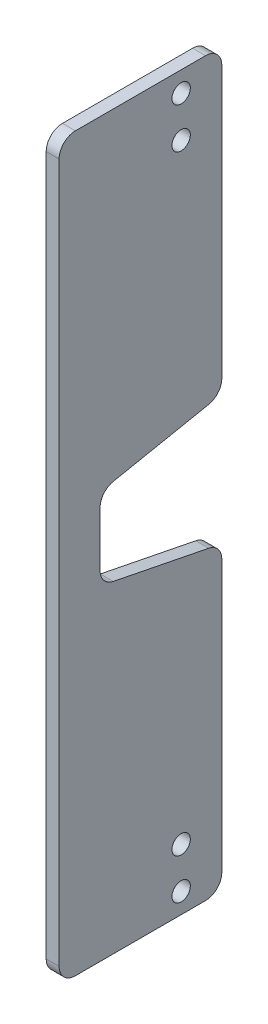
ISO-10303-21;
HEADER;
FILE_DESCRIPTION(('STEP AP214'),'2;1');
FILE_NAME('part.step','',(''),(''),'','','');
FILE_SCHEMA(('AUTOMOTIVE_DESIGN { 1 0 10303 214 1 1 1 1 }'));
ENDSEC;
DATA;
#1=APPLICATION_CONTEXT('core data for automotive mechanical design processes');
#2=APPLICATION_PROTOCOL_DEFINITION('international standard','automotive_design',2000,#1);
#3=PRODUCT_CONTEXT('',#1,'mechanical');
#4=PRODUCT('Part','Part','',(#3));
#5=PRODUCT_RELATED_PRODUCT_CATEGORY('part','',(#4));
#6=PRODUCT_DEFINITION_FORMATION('','',#4);
#7=PRODUCT_DEFINITION_CONTEXT('part definition',#1,'design');
#8=PRODUCT_DEFINITION('design','',#6,#7);
#9=PRODUCT_DEFINITION_SHAPE('','',#8);
#10=(LENGTH_UNIT() NAMED_UNIT(*) SI_UNIT(.MILLI.,.METRE.));
#11=(NAMED_UNIT(*) PLANE_ANGLE_UNIT() SI_UNIT($,.RADIAN.));
#12=(NAMED_UNIT(*) SI_UNIT($,.STERADIAN.) SOLID_ANGLE_UNIT());
#13=UNCERTAINTY_MEASURE_WITH_UNIT(LENGTH_MEASURE(1.E-05),#10,'distance_accuracy_value','');
#14=(GEOMETRIC_REPRESENTATION_CONTEXT(3) GLOBAL_UNCERTAINTY_ASSIGNED_CONTEXT((#13)) GLOBAL_UNIT_ASSIGNED_CONTEXT((#10,
#11,#12)) REPRESENTATION_CONTEXT('',''));
#15=CARTESIAN_POINT('',(0.,0.,0.));
#16=DIRECTION('',(0.,0.,1.));
#17=DIRECTION('',(1.,0.,0.));
#18=AXIS2_PLACEMENT_3D('',#15,#16,#17);
#19=CARTESIAN_POINT('',(0.794249999999999,-50.77,-0.0391447555514952));
#20=DIRECTION('',(0.,-0.980796557409384,-0.195033620111768));
#21=DIRECTION('',(0.,0.195033620111768,-0.980796557409384));
#22=AXIS2_PLACEMENT_3D('',#19,#20,#21);
#23=PLANE('',#22);
#24=DIRECTION('',(0.,-0.195033620111768,0.980796557409384));
#25=VECTOR('',#24,1.);
#26=CARTESIAN_POINT('',(0.794249999999999,-50.77,-0.0391447555514952));
#27=LINE('',#26,#25);
#28=CARTESIAN_POINT('',(0.794250000000003,-48.1151387809773,-13.3900672402235));
#29=VERTEX_POINT('',#28);
#30=CARTESIAN_POINT('',(0.794249999999999,-50.4498612190227,-1.64907751532796));
#31=VERTEX_POINT('',#30);
#32=EDGE_CURVE('E248',#29,#31,#27,.T.);
#33=ORIENTED_EDGE('',*,*,#32,.T.);
#34=DIRECTION('',(-1.,0.,0.));
#35=VECTOR('',#34,1.);
#36=CARTESIAN_POINT('',(-0.793750000000001,-50.4498612190227,-1.64907751532796));
#37=LINE('',#36,#35);
#38=CARTESIAN_POINT('',(-0.793750000000001,-50.4498612190227,-1.64907751532796));
#39=VERTEX_POINT('',#38);
#40=EDGE_CURVE('E283',#31,#39,#37,.T.);
#41=ORIENTED_EDGE('',*,*,#40,.T.);
#42=DIRECTION('',(0.,-0.195033620111768,0.980796557409384));
#43=VECTOR('',#42,1.);
#44=CARTESIAN_POINT('',(-0.793750000000002,-50.77,-0.0391447555514957));
#45=LINE('',#44,#43);
#46=CARTESIAN_POINT('',(-0.793749999999997,-48.1151387809773,-13.3900672402235));
#47=VERTEX_POINT('',#46);
#48=EDGE_CURVE('E203',#47,#39,#45,.T.);
#49=ORIENTED_EDGE('',*,*,#48,.F.);
#50=DIRECTION('',(-1.,0.,0.));
#51=VECTOR('',#50,1.);
#52=CARTESIAN_POINT('',(0.794250000000003,-48.1151387809773,-13.3900672402235));
#53=LINE('',#52,#51);
#54=EDGE_CURVE('E277',#47,#29,#53,.F.);
#55=ORIENTED_EDGE('',*,*,#54,.T.);
#56=EDGE_LOOP('',(#33,#41,#49,#55));
#57=FACE_BOUND('',#56,.T.);
#58=ADVANCED_FACE('F39',(#57),#23,.T.);
#59=CARTESIAN_POINT('',(0.794250000000003,-12.795,-15.));
#60=DIRECTION('',(0.,0.,-1.));
#61=DIRECTION('',(-1.,0.,0.));
#62=AXIS2_PLACEMENT_3D('',#59,#60,#61);
#63=PLANE('',#62);
#64=DIRECTION('',(0.,-1.,0.));
#65=VECTOR('',#64,1.);
#66=CARTESIAN_POINT('',(0.794250000000003,-12.795,-15.));
#67=LINE('',#66,#65);
#68=CARTESIAN_POINT('',(0.794250000000003,-12.795,-15.));
#69=VERTEX_POINT('',#68);
#70=CARTESIAN_POINT('',(0.794250000000003,-46.1535456661585,-15.));
#71=VERTEX_POINT('',#70);
#72=EDGE_CURVE('E168',#69,#71,#67,.T.);
#73=ORIENTED_EDGE('',*,*,#72,.T.);
#74=DIRECTION('',(-1.,0.,0.));
#75=VECTOR('',#74,1.);
#76=CARTESIAN_POINT('',(0.794250000000003,-46.1535456661585,-15.));
#77=LINE('',#76,#75);
#78=CARTESIAN_POINT('',(-0.793749999999997,-46.1535456661585,-15.));
#79=VERTEX_POINT('',#78);
#80=EDGE_CURVE('E252',#71,#79,#77,.T.);
#81=ORIENTED_EDGE('',*,*,#80,.T.);
#82=DIRECTION('',(0.,-1.,0.));
#83=VECTOR('',#82,1.);
#84=CARTESIAN_POINT('',(-0.793749999999997,-12.795,-15.));
#85=LINE('',#84,#83);
#86=CARTESIAN_POINT('',(-0.793749999999997,-12.795,-15.));
#87=VERTEX_POINT('',#86);
#88=EDGE_CURVE('E244',#87,#79,#85,.T.);
#89=ORIENTED_EDGE('',*,*,#88,.F.);
#90=DIRECTION('',(-1.,0.,0.));
#91=VECTOR('',#90,1.);
#92=CARTESIAN_POINT('',(0.794250000000003,-12.795,-15.));
#93=LINE('',#92,#91);
#94=EDGE_CURVE('E249',#69,#87,#93,.T.);
#95=ORIENTED_EDGE('',*,*,#94,.F.);
#96=EDGE_LOOP('',(#73,#81,#89,#95));
#97=FACE_BOUND('',#96,.T.);
#98=ADVANCED_FACE('F407',(#97),#63,.T.);
#99=CARTESIAN_POINT('',(0.794250000000003,-12.795,-13.));
#100=DIRECTION('',(-1.,0.,0.));
#101=DIRECTION('',(0.,0.,1.));
#102=AXIS2_PLACEMENT_3D('',#99,#100,#101);
#103=CYLINDRICAL_SURFACE('',#102,2.);
#104=CARTESIAN_POINT('',(-0.793749999999998,-12.795,-13.));
#105=DIRECTION('',(-1.,0.,0.));
#106=DIRECTION('',(0.,0.,1.));
#107=AXIS2_PLACEMENT_3D('',#104,#105,#106);
#108=CIRCLE('',#107,2.);
#109=CARTESIAN_POINT('',(-0.793749999999998,-10.795,-13.));
#110=VERTEX_POINT('',#109);
#111=EDGE_CURVE('E240',#110,#87,#108,.T.);
#112=ORIENTED_EDGE('',*,*,#111,.F.);
#113=DIRECTION('',(-1.,0.,0.));
#114=VECTOR('',#113,1.);
#115=CARTESIAN_POINT('',(0.794250000000003,-10.795,-13.));
#116=LINE('',#115,#114);
#117=CARTESIAN_POINT('',(0.794250000000003,-10.795,-13.));
#118=VERTEX_POINT('',#117);
#119=EDGE_CURVE('E253',#118,#110,#116,.T.);
#120=ORIENTED_EDGE('',*,*,#119,.F.);
#121=CARTESIAN_POINT('',(0.794250000000003,-12.795,-13.));
#122=DIRECTION('',(-1.,0.,0.));
#123=DIRECTION('',(0.,0.,1.));
#124=AXIS2_PLACEMENT_3D('',#121,#122,#123);
#125=CIRCLE('',#124,2.);
#126=EDGE_CURVE('E196',#118,#69,#125,.T.);
#127=ORIENTED_EDGE('',*,*,#126,.T.);
#128=ORIENTED_EDGE('',*,*,#94,.T.);
#129=EDGE_LOOP('',(#112,#120,#127,#128));
#130=FACE_BOUND('',#129,.T.);
#131=ADVANCED_FACE('F413',(#130),#103,.T.);
#132=CARTESIAN_POINT('',(0.794249999999998,-10.795,3.));
#133=DIRECTION('',(0.,1.,0.));
#134=DIRECTION('',(0.,0.,1.));
#135=AXIS2_PLACEMENT_3D('',#132,#133,#134);
#136=PLANE('',#135);
#137=DIRECTION('',(0.,0.,-1.));
#138=VECTOR('',#137,1.);
#139=CARTESIAN_POINT('',(-0.793750000000003,-10.795,3.));
#140=LINE('',#139,#138);
#141=CARTESIAN_POINT('',(-0.793750000000003,-10.795,3.));
#142=VERTEX_POINT('',#141);
#143=EDGE_CURVE('E236',#142,#110,#140,.T.);
#144=ORIENTED_EDGE('',*,*,#143,.F.);
#145=DIRECTION('',(-1.,0.,0.));
#146=VECTOR('',#145,1.);
#147=CARTESIAN_POINT('',(0.794249999999998,-10.795,3.));
#148=LINE('',#147,#146);
#149=CARTESIAN_POINT('',(0.794249999999998,-10.795,3.));
#150=VERTEX_POINT('',#149);
#151=EDGE_CURVE('E256',#150,#142,#148,.T.);
#152=ORIENTED_EDGE('',*,*,#151,.F.);
#153=DIRECTION('',(0.,0.,-1.));
#154=VECTOR('',#153,1.);
#155=CARTESIAN_POINT('',(0.794249999999998,-10.795,3.));
#156=LINE('',#155,#154);
#157=EDGE_CURVE('E192',#150,#118,#156,.T.);
#158=ORIENTED_EDGE('',*,*,#157,.T.);
#159=ORIENTED_EDGE('',*,*,#119,.T.);
#160=EDGE_LOOP('',(#144,#152,#158,#159));
#161=FACE_BOUND('',#160,.T.);
#162=ADVANCED_FACE('F569',(#161),#136,.T.);
#163=CARTESIAN_POINT('',(0.794249999999998,-12.795,3.));
#164=DIRECTION('',(-1.,0.,0.));
#165=DIRECTION('',(0.,0.,1.));
#166=AXIS2_PLACEMENT_3D('',#163,#164,#165);
#167=CYLINDRICAL_SURFACE('',#166,2.);
#168=CARTESIAN_POINT('',(-0.793750000000003,-12.795,3.));
#169=DIRECTION('',(-1.,0.,0.));
#170=DIRECTION('',(0.,0.,1.));
#171=AXIS2_PLACEMENT_3D('',#168,#169,#170);
#172=CIRCLE('',#171,2.);
#173=CARTESIAN_POINT('',(-0.793750000000003,-12.795,5.));
#174=VERTEX_POINT('',#173);
#175=EDGE_CURVE('E232',#174,#142,#172,.T.);
#176=ORIENTED_EDGE('',*,*,#175,.F.);
#177=DIRECTION('',(-1.,0.,0.));
#178=VECTOR('',#177,1.);
#179=CARTESIAN_POINT('',(0.794249999999997,-12.795,5.));
#180=LINE('',#179,#178);
#181=CARTESIAN_POINT('',(0.794249999999997,-12.795,5.));
#182=VERTEX_POINT('',#181);
#183=EDGE_CURVE('E259',#182,#174,#180,.T.);
#184=ORIENTED_EDGE('',*,*,#183,.F.);
#185=CARTESIAN_POINT('',(0.794249999999998,-12.795,3.));
#186=DIRECTION('',(-1.,0.,0.));
#187=DIRECTION('',(0.,0.,1.));
#188=AXIS2_PLACEMENT_3D('',#185,#186,#187);
#189=CIRCLE('',#188,2.);
#190=EDGE_CURVE('E188',#182,#150,#189,.T.);
#191=ORIENTED_EDGE('',*,*,#190,.T.);
#192=ORIENTED_EDGE('',*,*,#151,.T.);
#193=EDGE_LOOP('',(#176,#184,#191,#192));
#194=FACE_BOUND('',#193,.T.);
#195=ADVANCED_FACE('F558',(#194),#167,.T.);
#196=CARTESIAN_POINT('',(0.794249999999997,-38.795,5.));
#197=DIRECTION('',(0.,0.,1.));
#198=DIRECTION('',(1.,0.,0.));
#199=AXIS2_PLACEMENT_3D('',#196,#197,#198);
#200=PLANE('',#199);
#201=DIRECTION('',(0.,1.,0.));
#202=VECTOR('',#201,1.);
#203=CARTESIAN_POINT('',(-0.793750000000003,-38.795,5.));
#204=LINE('',#203,#202);
#205=CARTESIAN_POINT('',(-0.793750000000003,-98.745,5.));
#206=VERTEX_POINT('',#205);
#207=EDGE_CURVE('E228',#206,#174,#204,.T.);
#208=ORIENTED_EDGE('',*,*,#207,.F.);
#209=DIRECTION('',(-1.,0.,0.));
#210=VECTOR('',#209,1.);
#211=CARTESIAN_POINT('',(0.794249999999997,-98.745,5.));
#212=LINE('',#211,#210);
#213=CARTESIAN_POINT('',(0.794249999999997,-98.745,5.));
#214=VERTEX_POINT('',#213);
#215=EDGE_CURVE('E262',#214,#206,#212,.T.);
#216=ORIENTED_EDGE('',*,*,#215,.F.);
#217=DIRECTION('',(0.,1.,0.));
#218=VECTOR('',#217,1.);
#219=CARTESIAN_POINT('',(0.794249999999997,-72.745,5.));
#220=LINE('',#219,#218);
#221=EDGE_CURVE('E185',#214,#182,#220,.T.);
#222=ORIENTED_EDGE('',*,*,#221,.T.);
#223=ORIENTED_EDGE('',*,*,#183,.T.);
#224=EDGE_LOOP('',(#208,#216,#222,#223));
#225=FACE_BOUND('',#224,.T.);
#226=ADVANCED_FACE('F548',(#225),#200,.T.);
#227=CARTESIAN_POINT('',(0.794249999999998,-98.745,3.));
#228=DIRECTION('',(-1.,0.,0.));
#229=DIRECTION('',(0.,0.,1.));
#230=AXIS2_PLACEMENT_3D('',#227,#228,#229);
#231=CYLINDRICAL_SURFACE('',#230,2.);
#232=CARTESIAN_POINT('',(-0.793750000000003,-98.745,3.));
#233=DIRECTION('',(-1.,0.,0.));
#234=DIRECTION('',(0.,0.,-1.));
#235=AXIS2_PLACEMENT_3D('',#232,#233,#234);
#236=CIRCLE('',#235,2.);
#237=CARTESIAN_POINT('',(-0.793750000000003,-100.745,3.));
#238=VERTEX_POINT('',#237);
#239=EDGE_CURVE('E224',#238,#206,#236,.T.);
#240=ORIENTED_EDGE('',*,*,#239,.F.);
#241=DIRECTION('',(-1.,0.,0.));
#242=VECTOR('',#241,1.);
#243=CARTESIAN_POINT('',(0.794249999999998,-100.745,3.));
#244=LINE('',#243,#242);
#245=CARTESIAN_POINT('',(0.794249999999998,-100.745,3.));
#246=VERTEX_POINT('',#245);
#247=EDGE_CURVE('E266',#246,#238,#244,.T.);
#248=ORIENTED_EDGE('',*,*,#247,.F.);
#249=CARTESIAN_POINT('',(0.794249999999998,-98.745,3.));
#250=DIRECTION('',(-1.,0.,0.));
#251=DIRECTION('',(0.,0.,-1.));
#252=AXIS2_PLACEMENT_3D('',#249,#250,#251);
#253=CIRCLE('',#252,2.);
#254=EDGE_CURVE('E178',#246,#214,#253,.T.);
#255=ORIENTED_EDGE('',*,*,#254,.T.);
#256=ORIENTED_EDGE('',*,*,#215,.T.);
#257=EDGE_LOOP('',(#240,#248,#255,#256));
#258=FACE_BOUND('',#257,.T.);
#259=ADVANCED_FACE('F538',(#258),#231,.T.);
#260=CARTESIAN_POINT('',(0.794249999999998,-100.745,3.));
#261=DIRECTION('',(0.,-1.,0.));
#262=DIRECTION('',(0.,0.,-1.));
#263=AXIS2_PLACEMENT_3D('',#260,#261,#262);
#264=PLANE('',#263);
#265=DIRECTION('',(0.,0.,1.));
#266=VECTOR('',#265,1.);
#267=CARTESIAN_POINT('',(-0.793750000000003,-100.745,3.));
#268=LINE('',#267,#266);
#269=CARTESIAN_POINT('',(-0.793749999999998,-100.745,-13.));
#270=VERTEX_POINT('',#269);
#271=EDGE_CURVE('E220',#270,#238,#268,.T.);
#272=ORIENTED_EDGE('',*,*,#271,.F.);
#273=DIRECTION('',(-1.,0.,0.));
#274=VECTOR('',#273,1.);
#275=CARTESIAN_POINT('',(0.794250000000003,-100.745,-13.));
#276=LINE('',#275,#274);
#277=CARTESIAN_POINT('',(0.794250000000003,-100.745,-13.));
#278=VERTEX_POINT('',#277);
#279=EDGE_CURVE('E167',#278,#270,#276,.T.);
#280=ORIENTED_EDGE('',*,*,#279,.F.);
#281=DIRECTION('',(0.,0.,1.));
#282=VECTOR('',#281,1.);
#283=CARTESIAN_POINT('',(0.794249999999998,-100.745,3.));
#284=LINE('',#283,#282);
#285=EDGE_CURVE('E174',#278,#246,#284,.T.);
#286=ORIENTED_EDGE('',*,*,#285,.T.);
#287=ORIENTED_EDGE('',*,*,#247,.T.);
#288=EDGE_LOOP('',(#272,#280,#286,#287));
#289=FACE_BOUND('',#288,.T.);
#290=ADVANCED_FACE('F529',(#289),#264,.T.);
#291=CARTESIAN_POINT('',(0.794250000000003,-98.745,-13.));
#292=DIRECTION('',(-1.,0.,0.));
#293=DIRECTION('',(0.,0.,1.));
#294=AXIS2_PLACEMENT_3D('',#291,#292,#293);
#295=CYLINDRICAL_SURFACE('',#294,2.);
#296=CARTESIAN_POINT('',(-0.793749999999998,-98.745,-13.));
#297=DIRECTION('',(-1.,0.,0.));
#298=DIRECTION('',(0.,0.,-1.));
#299=AXIS2_PLACEMENT_3D('',#296,#297,#298);
#300=CIRCLE('',#299,2.);
#301=CARTESIAN_POINT('',(-0.793749999999997,-98.745,-15.));
#302=VERTEX_POINT('',#301);
#303=EDGE_CURVE('E165',#302,#270,#300,.T.);
#304=ORIENTED_EDGE('',*,*,#303,.F.);
#305=DIRECTION('',(-1.,0.,0.));
#306=VECTOR('',#305,1.);
#307=CARTESIAN_POINT('',(0.794250000000003,-98.745,-15.));
#308=LINE('',#307,#306);
#309=CARTESIAN_POINT('',(0.794250000000003,-98.745,-15.));
#310=VERTEX_POINT('',#309);
#311=EDGE_CURVE('E152',#310,#302,#308,.T.);
#312=ORIENTED_EDGE('',*,*,#311,.F.);
#313=CARTESIAN_POINT('',(0.794250000000003,-98.745,-13.));
#314=DIRECTION('',(-1.,0.,0.));
#315=DIRECTION('',(0.,0.,-1.));
#316=AXIS2_PLACEMENT_3D('',#313,#314,#315);
#317=CIRCLE('',#316,2.);
#318=EDGE_CURVE('E158',#310,#278,#317,.T.);
#319=ORIENTED_EDGE('',*,*,#318,.T.);
#320=ORIENTED_EDGE('',*,*,#279,.T.);
#321=EDGE_LOOP('',(#304,#312,#319,#320));
#322=FACE_BOUND('',#321,.T.);
#323=ADVANCED_FACE('F163',(#322),#295,.T.);
#324=CARTESIAN_POINT('',(0.794250000000003,-98.745,-15.));
#325=DIRECTION('',(0.,0.,-1.));
#326=DIRECTION('',(-1.,0.,0.));
#327=AXIS2_PLACEMENT_3D('',#324,#325,#326);
#328=PLANE('',#327);
#329=DIRECTION('',(0.,-1.,0.));
#330=VECTOR('',#329,1.);
#331=CARTESIAN_POINT('',(-0.793749999999997,-98.745,-15.));
#332=LINE('',#331,#330);
#333=CARTESIAN_POINT('',(-0.793749999999997,-65.3864543338415,-15.));
#334=VERTEX_POINT('',#333);
#335=EDGE_CURVE('E215',#334,#302,#332,.T.);
#336=ORIENTED_EDGE('',*,*,#335,.F.);
#337=DIRECTION('',(-1.,0.,0.));
#338=VECTOR('',#337,1.);
#339=CARTESIAN_POINT('',(0.794250000000003,-65.3864543338415,-15.));
#340=LINE('',#339,#338);
#341=CARTESIAN_POINT('',(0.794250000000003,-65.3864543338415,-15.));
#342=VERTEX_POINT('',#341);
#343=EDGE_CURVE('E48',#334,#342,#340,.F.);
#344=ORIENTED_EDGE('',*,*,#343,.T.);
#345=DIRECTION('',(0.,-1.,0.));
#346=VECTOR('',#345,1.);
#347=CARTESIAN_POINT('',(0.794250000000003,-98.745,-15.));
#348=LINE('',#347,#346);
#349=EDGE_CURVE('E149',#342,#310,#348,.T.);
#350=ORIENTED_EDGE('',*,*,#349,.T.);
#351=ORIENTED_EDGE('',*,*,#311,.T.);
#352=EDGE_LOOP('',(#336,#344,#350,#351));
#353=FACE_BOUND('',#352,.T.);
#354=ADVANCED_FACE('F151',(#353),#328,.T.);
#355=CARTESIAN_POINT('',(0.794249999999999,-60.77,-0.0391447555514938));
#356=DIRECTION('',(0.,0.980796557409384,-0.195033620111768));
#357=DIRECTION('',(0.,0.195033620111768,0.980796557409384));
#358=AXIS2_PLACEMENT_3D('',#355,#356,#357);
#359=PLANE('',#358);
#360=DIRECTION('',(0.,-0.195033620111768,-0.980796557409384));
#361=VECTOR('',#360,1.);
#362=CARTESIAN_POINT('',(0.794249999999999,-60.77,-0.0391447555514938));
#363=LINE('',#362,#361);
#364=CARTESIAN_POINT('',(0.794249999999999,-61.0901387809773,-1.64907751532796));
#365=VERTEX_POINT('',#364);
#366=CARTESIAN_POINT('',(0.794250000000003,-63.4248612190227,-13.3900672402235));
#367=VERTEX_POINT('',#366);
#368=EDGE_CURVE('E159',#365,#367,#363,.T.);
#369=ORIENTED_EDGE('',*,*,#368,.T.);
#370=DIRECTION('',(-1.,0.,0.));
#371=VECTOR('',#370,1.);
#372=CARTESIAN_POINT('',(0.794250000000003,-63.4248612190227,-13.3900672402235));
#373=LINE('',#372,#371);
#374=CARTESIAN_POINT('',(-0.793749999999997,-63.4248612190227,-13.3900672402235));
#375=VERTEX_POINT('',#374);
#376=EDGE_CURVE('E309',#367,#375,#373,.T.);
#377=ORIENTED_EDGE('',*,*,#376,.T.);
#378=DIRECTION('',(0.,-0.195033620111768,-0.980796557409384));
#379=VECTOR('',#378,1.);
#380=CARTESIAN_POINT('',(-0.793750000000002,-60.77,-0.0391447555514943));
#381=LINE('',#380,#379);
#382=CARTESIAN_POINT('',(-0.793750000000001,-61.0901387809773,-1.64907751532796));
#383=VERTEX_POINT('',#382);
#384=EDGE_CURVE('E212',#383,#375,#381,.T.);
#385=ORIENTED_EDGE('',*,*,#384,.F.);
#386=DIRECTION('',(-1.,0.,0.));
#387=VECTOR('',#386,1.);
#388=CARTESIAN_POINT('',(0.794249999999999,-61.0901387809773,-1.64907751532796));
#389=LINE('',#388,#387);
#390=EDGE_CURVE('E300',#383,#365,#389,.F.);
#391=ORIENTED_EDGE('',*,*,#390,.T.);
#392=EDGE_LOOP('',(#369,#377,#385,#391));
#393=FACE_BOUND('',#392,.T.);
#394=ADVANCED_FACE('F319',(#393),#359,.T.);
#395=CARTESIAN_POINT('',(0.794249999999999,-55.77,-0.0391447555514949));
#396=DIRECTION('',(0.,0.,-1.));
#397=DIRECTION('',(-1.,0.,0.));
#398=AXIS2_PLACEMENT_3D('',#395,#396,#397);
#399=PLANE('',#398);
#400=DIRECTION('',(0.,-1.,0.));
#401=VECTOR('',#400,1.);
#402=CARTESIAN_POINT('',(0.794249999999999,-55.77,-0.0391447555514949));
#403=LINE('',#402,#401);
#404=CARTESIAN_POINT('',(0.794249999999999,-52.4114543338415,-0.0391447555514951));
#405=VERTEX_POINT('',#404);
#406=CARTESIAN_POINT('',(0.794249999999999,-59.1285456661585,-0.0391447555514947));
#407=VERTEX_POINT('',#406);
#408=EDGE_CURVE('E334',#405,#407,#403,.T.);
#409=ORIENTED_EDGE('',*,*,#408,.T.);
#410=DIRECTION('',(-1.,0.,0.));
#411=VECTOR('',#410,1.);
#412=CARTESIAN_POINT('',(-0.793750000000001,-59.1285456661585,-0.0391447555514947));
#413=LINE('',#412,#411);
#414=CARTESIAN_POINT('',(-0.793750000000002,-59.1285456661585,-0.0391447555514946));
#415=VERTEX_POINT('',#414);
#416=EDGE_CURVE('E296',#407,#415,#413,.T.);
#417=ORIENTED_EDGE('',*,*,#416,.T.);
#418=DIRECTION('',(0.,-1.,0.));
#419=VECTOR('',#418,1.);
#420=CARTESIAN_POINT('',(-0.793750000000002,-55.77,-0.0391447555514954));
#421=LINE('',#420,#419);
#422=CARTESIAN_POINT('',(-0.793750000000002,-52.4114543338415,-0.0391447555514961));
#423=VERTEX_POINT('',#422);
#424=EDGE_CURVE('E207',#423,#415,#421,.T.);
#425=ORIENTED_EDGE('',*,*,#424,.F.);
#426=DIRECTION('',(-1.,0.,0.));
#427=VECTOR('',#426,1.);
#428=CARTESIAN_POINT('',(0.794249999999999,-52.4114543338415,-0.0391447555514956));
#429=LINE('',#428,#427);
#430=EDGE_CURVE('E287',#423,#405,#429,.F.);
#431=ORIENTED_EDGE('',*,*,#430,.T.);
#432=EDGE_LOOP('',(#409,#417,#425,#431));
#433=FACE_BOUND('',#432,.T.);
#434=ADVANCED_FACE('F331',(#433),#399,.T.);
#435=CARTESIAN_POINT('',(0.794250000000003,-12.795,-13.));
#436=DIRECTION('',(-1.,0.,0.));
#437=DIRECTION('',(0.,0.,1.));
#438=AXIS2_PLACEMENT_3D('',#435,#436,#437);
#439=PLANE('',#438);
#440=CARTESIAN_POINT('',(0.794250000000002,-98.245,-10.));
#441=DIRECTION('',(-1.,0.,0.));
#442=DIRECTION('',(0.,0.,1.));
#443=AXIS2_PLACEMENT_3D('',#440,#441,#442);
#444=CIRCLE('',#443,1.1303);
#445=CARTESIAN_POINT('',(0.794250000000001,-98.245,-8.86969999999999));
#446=VERTEX_POINT('',#445);
#447=EDGE_CURVE('E363',#446,#446,#444,.T.);
#448=ORIENTED_EDGE('',*,*,#447,.T.);
#449=EDGE_LOOP('',(#448));
#450=FACE_BOUND('',#449,.T.);
#451=CARTESIAN_POINT('',(0.794250000000002,-93.245,-10.));
#452=DIRECTION('',(-1.,0.,0.));
#453=DIRECTION('',(0.,0.,1.));
#454=AXIS2_PLACEMENT_3D('',#451,#452,#453);
#455=CIRCLE('',#454,1.1303);
#456=CARTESIAN_POINT('',(0.794250000000001,-93.245,-8.8697));
#457=VERTEX_POINT('',#456);
#458=EDGE_CURVE('E355',#457,#457,#455,.T.);
#459=ORIENTED_EDGE('',*,*,#458,.T.);
#460=EDGE_LOOP('',(#459));
#461=FACE_BOUND('',#460,.T.);
#462=CARTESIAN_POINT('',(0.794250000000002,-18.295,-10.));
#463=DIRECTION('',(-1.,0.,0.));
#464=DIRECTION('',(0.,0.,1.));
#465=AXIS2_PLACEMENT_3D('',#462,#463,#464);
#466=CIRCLE('',#465,1.1303);
#467=CARTESIAN_POINT('',(0.794250000000001,-18.295,-8.8697));
#468=VERTEX_POINT('',#467);
#469=EDGE_CURVE('E347',#468,#468,#466,.T.);
#470=ORIENTED_EDGE('',*,*,#469,.T.);
#471=EDGE_LOOP('',(#470));
#472=FACE_BOUND('',#471,.T.);
#473=CARTESIAN_POINT('',(0.794250000000002,-13.295,-10.));
#474=DIRECTION('',(-1.,0.,0.));
#475=DIRECTION('',(0.,0.,1.));
#476=AXIS2_PLACEMENT_3D('',#473,#474,#475);
#477=CIRCLE('',#476,1.1303);
#478=CARTESIAN_POINT('',(0.794250000000001,-13.295,-8.8697));
#479=VERTEX_POINT('',#478);
#480=EDGE_CURVE('E208',#479,#479,#477,.T.);
#481=ORIENTED_EDGE('',*,*,#480,.T.);
#482=EDGE_LOOP('',(#481));
#483=FACE_BOUND('',#482,.T.);
#484=ORIENTED_EDGE('',*,*,#349,.F.);
#485=CARTESIAN_POINT('',(0.794250000000003,-65.3864543338415,-13.));
#486=DIRECTION('',(-1.,0.,0.));
#487=DIRECTION('',(0.,0.,1.));
#488=AXIS2_PLACEMENT_3D('',#485,#486,#487);
#489=CIRCLE('',#488,2.);
#490=EDGE_CURVE('E11',#342,#367,#489,.F.);
#491=ORIENTED_EDGE('',*,*,#490,.T.);
#492=ORIENTED_EDGE('',*,*,#368,.F.);
#493=CARTESIAN_POINT('',(0.794249999999999,-59.1285456661585,-2.03914475555149));
#494=DIRECTION('',(-1.,0.,0.));
#495=DIRECTION('',(0.,0.,1.));
#496=AXIS2_PLACEMENT_3D('',#493,#494,#495);
#497=CIRCLE('',#496,2.);
#498=EDGE_CURVE('E306',#365,#407,#497,.T.);
#499=ORIENTED_EDGE('',*,*,#498,.T.);
#500=ORIENTED_EDGE('',*,*,#408,.F.);
#501=CARTESIAN_POINT('',(0.794249999999999,-52.4114543338415,-2.03914475555149));
#502=DIRECTION('',(-1.,0.,0.));
#503=DIRECTION('',(0.,0.,1.));
#504=AXIS2_PLACEMENT_3D('',#501,#502,#503);
#505=CIRCLE('',#504,2.);
#506=EDGE_CURVE('E293',#405,#31,#505,.T.);
#507=ORIENTED_EDGE('',*,*,#506,.T.);
#508=ORIENTED_EDGE('',*,*,#32,.F.);
#509=CARTESIAN_POINT('',(0.794250000000003,-46.1535456661585,-13.));
#510=DIRECTION('',(-1.,0.,0.));
#511=DIRECTION('',(0.,0.,1.));
#512=AXIS2_PLACEMENT_3D('',#509,#510,#511);
#513=CIRCLE('',#512,2.);
#514=EDGE_CURVE('E280',#29,#71,#513,.F.);
#515=ORIENTED_EDGE('',*,*,#514,.T.);
#516=ORIENTED_EDGE('',*,*,#72,.F.);
#517=ORIENTED_EDGE('',*,*,#126,.F.);
#518=ORIENTED_EDGE('',*,*,#157,.F.);
#519=ORIENTED_EDGE('',*,*,#190,.F.);
#520=ORIENTED_EDGE('',*,*,#221,.F.);
#521=ORIENTED_EDGE('',*,*,#254,.F.);
#522=ORIENTED_EDGE('',*,*,#285,.F.);
#523=ORIENTED_EDGE('',*,*,#318,.F.);
#524=EDGE_LOOP('',(#484,#491,#492,#499,#500,#507,#508,#515,#516,#517,#518,#519,#520,#521,#522,#523));
#525=FACE_BOUND('',#524,.T.);
#526=ADVANCED_FACE('F171',(#450,#461,#472,#483,#525),#439,.F.);
#527=CARTESIAN_POINT('',(-0.793749999999998,-12.795,-13.));
#528=DIRECTION('',(-1.,0.,0.));
#529=DIRECTION('',(0.,0.,1.));
#530=AXIS2_PLACEMENT_3D('',#527,#528,#529);
#531=PLANE('',#530);
#532=CARTESIAN_POINT('',(-0.793749999999998,-98.245,-10.));
#533=DIRECTION('',(-1.,0.,0.));
#534=DIRECTION('',(0.,0.,1.));
#535=AXIS2_PLACEMENT_3D('',#532,#533,#534);
#536=CIRCLE('',#535,1.1303);
#537=CARTESIAN_POINT('',(-0.793749999999999,-98.245,-8.86969999999999));
#538=VERTEX_POINT('',#537);
#539=EDGE_CURVE('E367',#538,#538,#536,.T.);
#540=ORIENTED_EDGE('',*,*,#539,.F.);
#541=EDGE_LOOP('',(#540));
#542=FACE_BOUND('',#541,.T.);
#543=CARTESIAN_POINT('',(-0.793749999999998,-93.245,-10.));
#544=DIRECTION('',(-1.,0.,0.));
#545=DIRECTION('',(0.,0.,1.));
#546=AXIS2_PLACEMENT_3D('',#543,#544,#545);
#547=CIRCLE('',#546,1.1303);
#548=CARTESIAN_POINT('',(-0.793749999999999,-93.245,-8.8697));
#549=VERTEX_POINT('',#548);
#550=EDGE_CURVE('E359',#549,#549,#547,.T.);
#551=ORIENTED_EDGE('',*,*,#550,.F.);
#552=EDGE_LOOP('',(#551));
#553=FACE_BOUND('',#552,.T.);
#554=CARTESIAN_POINT('',(-0.793749999999998,-18.295,-10.));
#555=DIRECTION('',(-1.,0.,0.));
#556=DIRECTION('',(0.,0.,1.));
#557=AXIS2_PLACEMENT_3D('',#554,#555,#556);
#558=CIRCLE('',#557,1.1303);
#559=CARTESIAN_POINT('',(-0.793749999999999,-18.295,-8.8697));
#560=VERTEX_POINT('',#559);
#561=EDGE_CURVE('E351',#560,#560,#558,.T.);
#562=ORIENTED_EDGE('',*,*,#561,.F.);
#563=EDGE_LOOP('',(#562));
#564=FACE_BOUND('',#563,.T.);
#565=CARTESIAN_POINT('',(-0.793749999999998,-13.295,-10.));
#566=DIRECTION('',(-1.,0.,0.));
#567=DIRECTION('',(0.,0.,1.));
#568=AXIS2_PLACEMENT_3D('',#565,#566,#567);
#569=CIRCLE('',#568,1.1303);
#570=CARTESIAN_POINT('',(-0.793749999999999,-13.295,-8.8697));
#571=VERTEX_POINT('',#570);
#572=EDGE_CURVE('E343',#571,#571,#569,.T.);
#573=ORIENTED_EDGE('',*,*,#572,.F.);
#574=EDGE_LOOP('',(#573));
#575=FACE_BOUND('',#574,.T.);
#576=ORIENTED_EDGE('',*,*,#384,.T.);
#577=CARTESIAN_POINT('',(-0.793749999999998,-65.3864543338415,-13.));
#578=DIRECTION('',(-1.,0.,0.));
#579=DIRECTION('',(0.,0.,1.));
#580=AXIS2_PLACEMENT_3D('',#577,#578,#579);
#581=CIRCLE('',#580,2.);
#582=EDGE_CURVE('E62',#375,#334,#581,.T.);
#583=ORIENTED_EDGE('',*,*,#582,.T.);
#584=ORIENTED_EDGE('',*,*,#335,.T.);
#585=ORIENTED_EDGE('',*,*,#303,.T.);
#586=ORIENTED_EDGE('',*,*,#271,.T.);
#587=ORIENTED_EDGE('',*,*,#239,.T.);
#588=ORIENTED_EDGE('',*,*,#207,.T.);
#589=ORIENTED_EDGE('',*,*,#175,.T.);
#590=ORIENTED_EDGE('',*,*,#143,.T.);
#591=ORIENTED_EDGE('',*,*,#111,.T.);
#592=ORIENTED_EDGE('',*,*,#88,.T.);
#593=CARTESIAN_POINT('',(-0.793749999999998,-46.1535456661585,-13.));
#594=DIRECTION('',(-1.,0.,0.));
#595=DIRECTION('',(0.,0.,1.));
#596=AXIS2_PLACEMENT_3D('',#593,#594,#595);
#597=CIRCLE('',#596,2.);
#598=EDGE_CURVE('E274',#79,#47,#597,.T.);
#599=ORIENTED_EDGE('',*,*,#598,.T.);
#600=ORIENTED_EDGE('',*,*,#48,.T.);
#601=CARTESIAN_POINT('',(-0.793750000000001,-52.4114543338415,-2.0391447555515));
#602=DIRECTION('',(-1.,0.,0.));
#603=DIRECTION('',(0.,0.,1.));
#604=AXIS2_PLACEMENT_3D('',#601,#602,#603);
#605=CIRCLE('',#604,2.);
#606=EDGE_CURVE('E290',#39,#423,#605,.F.);
#607=ORIENTED_EDGE('',*,*,#606,.T.);
#608=ORIENTED_EDGE('',*,*,#424,.T.);
#609=CARTESIAN_POINT('',(-0.793750000000001,-59.1285456661585,-2.03914475555149));
#610=DIRECTION('',(-1.,0.,0.));
#611=DIRECTION('',(0.,0.,1.));
#612=AXIS2_PLACEMENT_3D('',#609,#610,#611);
#613=CIRCLE('',#612,2.);
#614=EDGE_CURVE('E303',#415,#383,#613,.F.);
#615=ORIENTED_EDGE('',*,*,#614,.T.);
#616=EDGE_LOOP('',(#576,#583,#584,#585,#586,#587,#588,#589,#590,#591,#592,#599,#600,#607,#608,#615));
#617=FACE_BOUND('',#616,.T.);
#618=ADVANCED_FACE('F323',(#542,#553,#564,#575,#617),#531,.T.);
#619=CARTESIAN_POINT('',(0.794250000000002,-13.295,-10.));
#620=DIRECTION('',(-1.,0.,0.));
#621=DIRECTION('',(0.,0.,1.));
#622=AXIS2_PLACEMENT_3D('',#619,#620,#621);
#623=CYLINDRICAL_SURFACE('',#622,1.1303);
#624=ORIENTED_EDGE('',*,*,#480,.F.);
#625=EDGE_LOOP('',(#624));
#626=FACE_BOUND('',#625,.T.);
#627=ORIENTED_EDGE('',*,*,#572,.T.);
#628=EDGE_LOOP('',(#627));
#629=FACE_BOUND('',#628,.T.);
#630=ADVANCED_FACE('F387',(#626,#629),#623,.F.);
#631=CARTESIAN_POINT('',(0.794250000000002,-18.295,-10.));
#632=DIRECTION('',(-1.,0.,0.));
#633=DIRECTION('',(0.,0.,1.));
#634=AXIS2_PLACEMENT_3D('',#631,#632,#633);
#635=CYLINDRICAL_SURFACE('',#634,1.1303);
#636=ORIENTED_EDGE('',*,*,#469,.F.);
#637=EDGE_LOOP('',(#636));
#638=FACE_BOUND('',#637,.T.);
#639=ORIENTED_EDGE('',*,*,#561,.T.);
#640=EDGE_LOOP('',(#639));
#641=FACE_BOUND('',#640,.T.);
#642=ADVANCED_FACE('F396',(#638,#641),#635,.F.);
#643=CARTESIAN_POINT('',(0.794250000000002,-93.245,-10.));
#644=DIRECTION('',(-1.,0.,0.));
#645=DIRECTION('',(0.,0.,1.));
#646=AXIS2_PLACEMENT_3D('',#643,#644,#645);
#647=CYLINDRICAL_SURFACE('',#646,1.1303);
#648=ORIENTED_EDGE('',*,*,#458,.F.);
#649=EDGE_LOOP('',(#648));
#650=FACE_BOUND('',#649,.T.);
#651=ORIENTED_EDGE('',*,*,#550,.T.);
#652=EDGE_LOOP('',(#651));
#653=FACE_BOUND('',#652,.T.);
#654=ADVANCED_FACE('F381',(#650,#653),#647,.F.);
#655=CARTESIAN_POINT('',(0.794250000000002,-98.245,-10.));
#656=DIRECTION('',(-1.,0.,0.));
#657=DIRECTION('',(0.,0.,1.));
#658=AXIS2_PLACEMENT_3D('',#655,#656,#657);
#659=CYLINDRICAL_SURFACE('',#658,1.1303);
#660=ORIENTED_EDGE('',*,*,#447,.F.);
#661=EDGE_LOOP('',(#660));
#662=FACE_BOUND('',#661,.T.);
#663=ORIENTED_EDGE('',*,*,#539,.T.);
#664=EDGE_LOOP('',(#663));
#665=FACE_BOUND('',#664,.T.);
#666=ADVANCED_FACE('F377',(#662,#665),#659,.F.);
#667=CARTESIAN_POINT('',(0.794250000000003,-46.1535456661585,-13.));
#668=DIRECTION('',(-1.,0.,0.));
#669=DIRECTION('',(0.,0.,1.));
#670=AXIS2_PLACEMENT_3D('',#667,#668,#669);
#671=CYLINDRICAL_SURFACE('',#670,2.);
#672=ORIENTED_EDGE('',*,*,#514,.F.);
#673=ORIENTED_EDGE('',*,*,#54,.F.);
#674=ORIENTED_EDGE('',*,*,#598,.F.);
#675=ORIENTED_EDGE('',*,*,#80,.F.);
#676=EDGE_LOOP('',(#672,#673,#674,#675));
#677=FACE_BOUND('',#676,.T.);
#678=ADVANCED_FACE('F380',(#677),#671,.T.);
#679=CARTESIAN_POINT('',(0.794249999999999,-52.4114543338415,-2.03914475555149));
#680=DIRECTION('',(1.,0.,0.));
#681=DIRECTION('',(0.,0.,-1.));
#682=AXIS2_PLACEMENT_3D('',#679,#680,#681);
#683=CYLINDRICAL_SURFACE('',#682,2.);
#684=ORIENTED_EDGE('',*,*,#506,.F.);
#685=ORIENTED_EDGE('',*,*,#430,.F.);
#686=ORIENTED_EDGE('',*,*,#606,.F.);
#687=ORIENTED_EDGE('',*,*,#40,.F.);
#688=EDGE_LOOP('',(#684,#685,#686,#687));
#689=FACE_BOUND('',#688,.T.);
#690=ADVANCED_FACE('F421',(#689),#683,.F.);
#691=CARTESIAN_POINT('',(0.794249999999999,-59.1285456661585,-2.03914475555149));
#692=DIRECTION('',(1.,0.,0.));
#693=DIRECTION('',(0.,0.,-1.));
#694=AXIS2_PLACEMENT_3D('',#691,#692,#693);
#695=CYLINDRICAL_SURFACE('',#694,2.);
#696=ORIENTED_EDGE('',*,*,#498,.F.);
#697=ORIENTED_EDGE('',*,*,#390,.F.);
#698=ORIENTED_EDGE('',*,*,#614,.F.);
#699=ORIENTED_EDGE('',*,*,#416,.F.);
#700=EDGE_LOOP('',(#696,#697,#698,#699));
#701=FACE_BOUND('',#700,.T.);
#702=ADVANCED_FACE('F328',(#701),#695,.F.);
#703=CARTESIAN_POINT('',(0.794250000000003,-65.3864543338415,-13.));
#704=DIRECTION('',(-1.,0.,0.));
#705=DIRECTION('',(0.,0.,1.));
#706=AXIS2_PLACEMENT_3D('',#703,#704,#705);
#707=CYLINDRICAL_SURFACE('',#706,2.);
#708=ORIENTED_EDGE('',*,*,#490,.F.);
#709=ORIENTED_EDGE('',*,*,#343,.F.);
#710=ORIENTED_EDGE('',*,*,#582,.F.);
#711=ORIENTED_EDGE('',*,*,#376,.F.);
#712=EDGE_LOOP('',(#708,#709,#710,#711));
#713=FACE_BOUND('',#712,.T.);
#714=ADVANCED_FACE('F41',(#713),#707,.T.);
#715=CLOSED_SHELL('',(#58,#98,#131,#162,#195,#226,#259,#290,#323,#354,#394,#434,#526,#618,#630,
#642,#654,#666,#678,#690,#702,#714));
#716=MANIFOLD_SOLID_BREP('B2',#715);
#717=ADVANCED_BREP_SHAPE_REPRESENTATION('',(#18,#716),#14);
#718=SHAPE_DEFINITION_REPRESENTATION(#9,#717);
ENDSEC;
END-ISO-10303-21;
